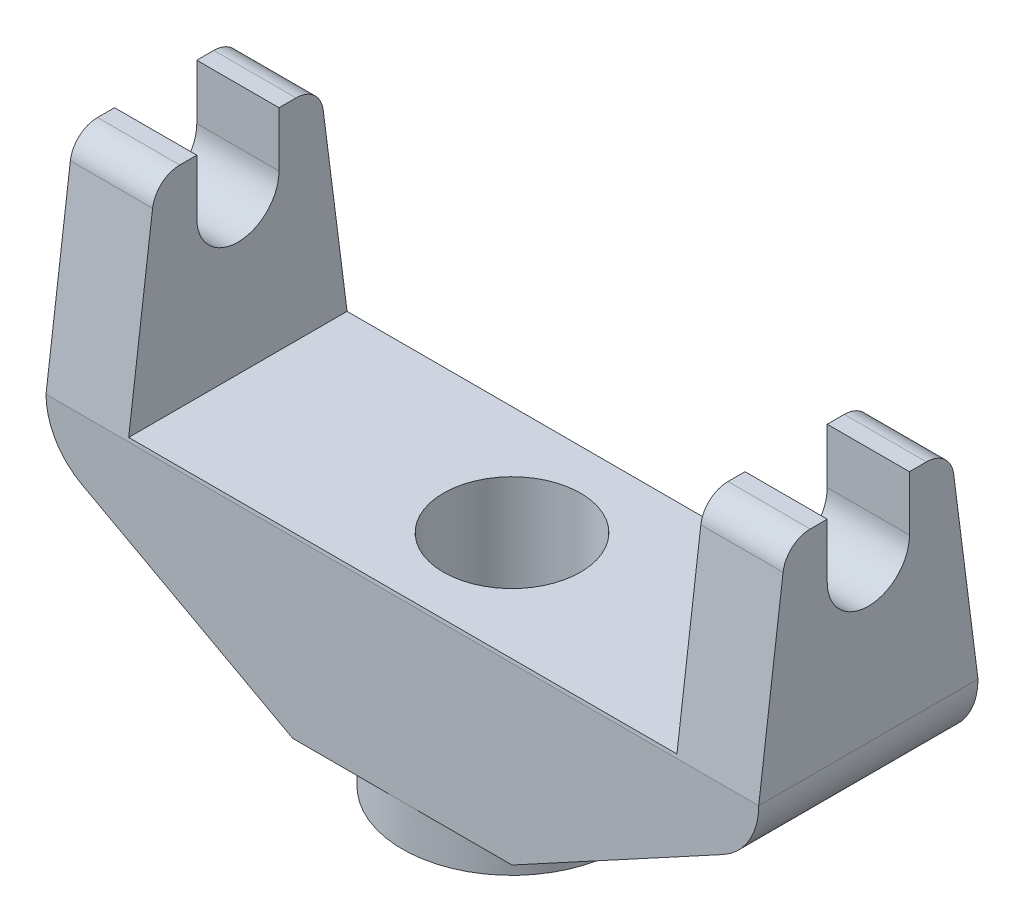
ISO-10303-21;
HEADER;
FILE_DESCRIPTION(('STEP AP214'),'2;1');
FILE_NAME('part.step','',(''),(''),'','','');
FILE_SCHEMA(('AUTOMOTIVE_DESIGN { 1 0 10303 214 1 1 1 1 }'));
ENDSEC;
DATA;
#1=APPLICATION_CONTEXT('core data for automotive mechanical design processes');
#2=APPLICATION_PROTOCOL_DEFINITION('international standard','automotive_design',2000,#1);
#3=PRODUCT_CONTEXT('',#1,'mechanical');
#4=PRODUCT('Part','Part','',(#3));
#5=PRODUCT_RELATED_PRODUCT_CATEGORY('part','',(#4));
#6=PRODUCT_DEFINITION_FORMATION('','',#4);
#7=PRODUCT_DEFINITION_CONTEXT('part definition',#1,'design');
#8=PRODUCT_DEFINITION('design','',#6,#7);
#9=PRODUCT_DEFINITION_SHAPE('','',#8);
#10=(LENGTH_UNIT() NAMED_UNIT(*) SI_UNIT(.MILLI.,.METRE.));
#11=(NAMED_UNIT(*) PLANE_ANGLE_UNIT() SI_UNIT($,.RADIAN.));
#12=(NAMED_UNIT(*) SI_UNIT($,.STERADIAN.) SOLID_ANGLE_UNIT());
#13=UNCERTAINTY_MEASURE_WITH_UNIT(LENGTH_MEASURE(1.E-05),#10,'distance_accuracy_value','');
#14=(GEOMETRIC_REPRESENTATION_CONTEXT(3) GLOBAL_UNCERTAINTY_ASSIGNED_CONTEXT((#13)) GLOBAL_UNIT_ASSIGNED_CONTEXT((#10,
#11,#12)) REPRESENTATION_CONTEXT('',''));
#15=CARTESIAN_POINT('',(0.,0.,0.));
#16=DIRECTION('',(0.,0.,1.));
#17=DIRECTION('',(1.,0.,0.));
#18=AXIS2_PLACEMENT_3D('',#15,#16,#17);
#19=CARTESIAN_POINT('',(165.1,180.036837313202,50.8));
#20=DIRECTION('',(-1.,0.,0.));
#21=DIRECTION('',(0.,0.,1.));
#22=AXIS2_PLACEMENT_3D('',#19,#20,#21);
#23=PLANE('',#22);
#24=DIRECTION('',(0.,-0.991887572463734,-0.127118226828417));
#25=VECTOR('',#24,1.);
#26=CARTESIAN_POINT('',(165.1,7.71313739939229,-60.1846432415168));
#27=LINE('',#26,#25);
#28=CARTESIAN_POINT('',(165.1,168.951238793923,-39.5207070097695));
#29=VERTEX_POINT('',#28);
#30=CARTESIAN_POINT('',(165.1,80.9403309774686,-50.8));
#31=VERTEX_POINT('',#30);
#32=EDGE_CURVE('E218',#29,#31,#27,.T.);
#33=ORIENTED_EDGE('',*,*,#32,.F.);
#34=CARTESIAN_POINT('',(165.1,167.336837313202,-26.9237348394801));
#35=DIRECTION('',(-1.,0.,0.));
#36=DIRECTION('',(0.,0.,1.));
#37=AXIS2_PLACEMENT_3D('',#34,#35,#36);
#38=CIRCLE('',#37,12.7);
#39=CARTESIAN_POINT('',(165.1,180.036837313202,-26.9237348394801));
#40=VERTEX_POINT('',#39);
#41=EDGE_CURVE('E294',#29,#40,#38,.F.);
#42=ORIENTED_EDGE('',*,*,#41,.T.);
#43=DIRECTION('',(0.,0.,-1.));
#44=VECTOR('',#43,1.);
#45=CARTESIAN_POINT('',(165.1,180.036837313202,50.8));
#46=LINE('',#45,#44);
#47=CARTESIAN_POINT('',(165.1,180.036837313202,-19.05));
#48=VERTEX_POINT('',#47);
#49=EDGE_CURVE('E279',#48,#40,#46,.T.);
#50=ORIENTED_EDGE('',*,*,#49,.F.);
#51=DIRECTION('',(0.,1.,0.));
#52=VECTOR('',#51,1.);
#53=CARTESIAN_POINT('',(165.1,0.,-19.05));
#54=LINE('',#53,#52);
#55=CARTESIAN_POINT('',(165.1,154.636837313202,-19.05));
#56=VERTEX_POINT('',#55);
#57=EDGE_CURVE('E351',#56,#48,#54,.T.);
#58=ORIENTED_EDGE('',*,*,#57,.F.);
#59=CARTESIAN_POINT('',(165.1,154.636837313202,0.));
#60=DIRECTION('',(1.,0.,0.));
#61=DIRECTION('',(0.,0.,-1.));
#62=AXIS2_PLACEMENT_3D('',#59,#60,#61);
#63=CIRCLE('',#62,19.05);
#64=CARTESIAN_POINT('',(165.1,154.636837313202,19.05));
#65=VERTEX_POINT('',#64);
#66=EDGE_CURVE('E346',#65,#56,#63,.T.);
#67=ORIENTED_EDGE('',*,*,#66,.F.);
#68=DIRECTION('',(0.,1.,0.));
#69=VECTOR('',#68,1.);
#70=CARTESIAN_POINT('',(165.1,0.,19.05));
#71=LINE('',#70,#69);
#72=CARTESIAN_POINT('',(165.1,180.036837313202,19.05));
#73=VERTEX_POINT('',#72);
#74=EDGE_CURVE('E343',#65,#73,#71,.T.);
#75=ORIENTED_EDGE('',*,*,#74,.T.);
#76=CARTESIAN_POINT('',(165.1,180.036837313202,26.9237348394801));
#77=VERTEX_POINT('',#76);
#78=EDGE_CURVE('E280',#77,#73,#46,.T.);
#79=ORIENTED_EDGE('',*,*,#78,.F.);
#80=CARTESIAN_POINT('',(165.1,167.336837313202,26.9237348394801));
#81=DIRECTION('',(-1.,0.,0.));
#82=DIRECTION('',(0.,0.,1.));
#83=AXIS2_PLACEMENT_3D('',#80,#81,#82);
#84=CIRCLE('',#83,12.7);
#85=CARTESIAN_POINT('',(165.1,168.951238793923,39.5207070097695));
#86=VERTEX_POINT('',#85);
#87=EDGE_CURVE('E292',#77,#86,#84,.F.);
#88=ORIENTED_EDGE('',*,*,#87,.T.);
#89=DIRECTION('',(0.,0.991887572463734,-0.127118226828417));
#90=VECTOR('',#89,1.);
#91=CARTESIAN_POINT('',(165.1,7.71313739939229,60.1846432415168));
#92=LINE('',#91,#90);
#93=CARTESIAN_POINT('',(165.1,80.9403309774686,50.8));
#94=VERTEX_POINT('',#93);
#95=EDGE_CURVE('E322',#94,#86,#92,.T.);
#96=ORIENTED_EDGE('',*,*,#95,.F.);
#97=DIRECTION('',(0.,0.,-1.));
#98=VECTOR('',#97,1.);
#99=CARTESIAN_POINT('',(165.1,80.9403309774686,50.8));
#100=LINE('',#99,#98);
#101=EDGE_CURVE('E282',#94,#31,#100,.T.);
#102=ORIENTED_EDGE('',*,*,#101,.T.);
#103=EDGE_LOOP('',(#33,#42,#50,#58,#67,#75,#79,#88,#96,#102));
#104=FACE_BOUND('',#103,.T.);
#105=ADVANCED_FACE('F33',(#104),#23,.F.);
#106=CARTESIAN_POINT('',(127.,180.036837313202,50.8));
#107=DIRECTION('',(0.,-1.,0.));
#108=DIRECTION('',(1.,0.,0.));
#109=AXIS2_PLACEMENT_3D('',#106,#107,#108);
#110=PLANE('',#109);
#111=DIRECTION('',(0.,0.,-1.));
#112=VECTOR('',#111,1.);
#113=CARTESIAN_POINT('',(127.,180.036837313202,50.8));
#114=LINE('',#113,#112);
#115=CARTESIAN_POINT('',(127.,180.036837313202,26.9237348394801));
#116=VERTEX_POINT('',#115);
#117=CARTESIAN_POINT('',(127.,180.036837313202,19.05));
#118=VERTEX_POINT('',#117);
#119=EDGE_CURVE('E277',#116,#118,#114,.T.);
#120=ORIENTED_EDGE('',*,*,#119,.F.);
#121=DIRECTION('',(1.,0.,0.));
#122=VECTOR('',#121,1.);
#123=CARTESIAN_POINT('',(127.,180.036837313202,26.9237348394801));
#124=LINE('',#123,#122);
#125=EDGE_CURVE('E11',#116,#77,#124,.T.);
#126=ORIENTED_EDGE('',*,*,#125,.T.);
#127=ORIENTED_EDGE('',*,*,#78,.T.);
#128=DIRECTION('',(1.,0.,0.));
#129=VECTOR('',#128,1.);
#130=CARTESIAN_POINT('',(-165.1,180.036837313202,19.05));
#131=LINE('',#130,#129);
#132=EDGE_CURVE('E365',#118,#73,#131,.T.);
#133=ORIENTED_EDGE('',*,*,#132,.F.);
#134=EDGE_LOOP('',(#120,#126,#127,#133));
#135=FACE_BOUND('',#134,.T.);
#136=ADVANCED_FACE('F336',(#135),#110,.F.);
#137=CARTESIAN_POINT('',(127.,82.55,50.8));
#138=DIRECTION('',(1.,0.,0.));
#139=DIRECTION('',(0.,0.,-1.));
#140=AXIS2_PLACEMENT_3D('',#137,#138,#139);
#141=PLANE('',#140);
#142=CARTESIAN_POINT('',(127.,180.036837313202,-19.05));
#143=VERTEX_POINT('',#142);
#144=CARTESIAN_POINT('',(127.,180.036837313202,-26.9237348394801));
#145=VERTEX_POINT('',#144);
#146=EDGE_CURVE('E276',#143,#145,#114,.T.);
#147=ORIENTED_EDGE('',*,*,#146,.T.);
#148=CARTESIAN_POINT('',(127.,167.336837313202,-26.9237348394801));
#149=DIRECTION('',(1.,0.,0.));
#150=DIRECTION('',(0.,0.,-1.));
#151=AXIS2_PLACEMENT_3D('',#148,#149,#150);
#152=CIRCLE('',#151,12.7);
#153=CARTESIAN_POINT('',(127.,168.951238793923,-39.5207070097695));
#154=VERTEX_POINT('',#153);
#155=EDGE_CURVE('E300',#145,#154,#152,.F.);
#156=ORIENTED_EDGE('',*,*,#155,.T.);
#157=DIRECTION('',(0.,-0.991887572463734,-0.127118226828417));
#158=VECTOR('',#157,1.);
#159=CARTESIAN_POINT('',(127.,95.334427413649,-48.9552828500315));
#160=LINE('',#159,#158);
#161=CARTESIAN_POINT('',(127.,82.55,-50.5937082008029));
#162=VERTEX_POINT('',#161);
#163=EDGE_CURVE('E349',#154,#162,#160,.T.);
#164=ORIENTED_EDGE('',*,*,#163,.T.);
#165=DIRECTION('',(0.,0.,-1.));
#166=VECTOR('',#165,1.);
#167=CARTESIAN_POINT('',(127.,82.55,50.8));
#168=LINE('',#167,#166);
#169=CARTESIAN_POINT('',(127.,82.55,50.5937082008029));
#170=VERTEX_POINT('',#169);
#171=EDGE_CURVE('E273',#170,#162,#168,.T.);
#172=ORIENTED_EDGE('',*,*,#171,.F.);
#173=DIRECTION('',(0.,0.991887572463734,-0.127118226828417));
#174=VECTOR('',#173,1.);
#175=CARTESIAN_POINT('',(127.,82.5239892880962,50.5970416789788));
#176=LINE('',#175,#174);
#177=CARTESIAN_POINT('',(127.,168.951238793923,39.5207070097695));
#178=VERTEX_POINT('',#177);
#179=EDGE_CURVE('E319',#170,#178,#176,.T.);
#180=ORIENTED_EDGE('',*,*,#179,.T.);
#181=CARTESIAN_POINT('',(127.,167.336837313202,26.9237348394801));
#182=DIRECTION('',(1.,0.,0.));
#183=DIRECTION('',(0.,0.,-1.));
#184=AXIS2_PLACEMENT_3D('',#181,#182,#183);
#185=CIRCLE('',#184,12.7);
#186=EDGE_CURVE('E298',#178,#116,#185,.F.);
#187=ORIENTED_EDGE('',*,*,#186,.T.);
#188=ORIENTED_EDGE('',*,*,#119,.T.);
#189=DIRECTION('',(0.,1.,0.));
#190=VECTOR('',#189,1.);
#191=CARTESIAN_POINT('',(127.,82.55,19.05));
#192=LINE('',#191,#190);
#193=CARTESIAN_POINT('',(127.,154.636837313202,19.05));
#194=VERTEX_POINT('',#193);
#195=EDGE_CURVE('E391',#194,#118,#192,.T.);
#196=ORIENTED_EDGE('',*,*,#195,.F.);
#197=CARTESIAN_POINT('',(127.,154.636837313202,0.));
#198=DIRECTION('',(1.,0.,0.));
#199=DIRECTION('',(0.,0.,-1.));
#200=AXIS2_PLACEMENT_3D('',#197,#198,#199);
#201=CIRCLE('',#200,19.05);
#202=CARTESIAN_POINT('',(127.,154.636837313202,-19.05));
#203=VERTEX_POINT('',#202);
#204=EDGE_CURVE('E380',#194,#203,#201,.T.);
#205=ORIENTED_EDGE('',*,*,#204,.T.);
#206=DIRECTION('',(0.,1.,0.));
#207=VECTOR('',#206,1.);
#208=CARTESIAN_POINT('',(127.,82.55,-19.05));
#209=LINE('',#208,#207);
#210=EDGE_CURVE('E386',#203,#143,#209,.T.);
#211=ORIENTED_EDGE('',*,*,#210,.T.);
#212=EDGE_LOOP('',(#147,#156,#164,#172,#180,#187,#188,#196,#205,#211));
#213=FACE_BOUND('',#212,.T.);
#214=ADVANCED_FACE('F328',(#213),#141,.F.);
#215=CARTESIAN_POINT('',(-127.,82.55,50.8));
#216=DIRECTION('',(-1.,0.,0.));
#217=DIRECTION('',(0.,0.,1.));
#218=AXIS2_PLACEMENT_3D('',#215,#216,#217);
#219=PLANE('',#218);
#220=DIRECTION('',(0.,0.991887572463734,0.127118226828417));
#221=VECTOR('',#220,1.);
#222=CARTESIAN_POINT('',(-127.,95.334427413649,-48.9552828500315));
#223=LINE('',#222,#221);
#224=CARTESIAN_POINT('',(-127.,82.55,-50.5937082008029));
#225=VERTEX_POINT('',#224);
#226=CARTESIAN_POINT('',(-127.,168.951238793923,-39.5207070097695));
#227=VERTEX_POINT('',#226);
#228=EDGE_CURVE('E353',#225,#227,#223,.T.);
#229=ORIENTED_EDGE('',*,*,#228,.T.);
#230=CARTESIAN_POINT('',(-127.,167.336837313202,-26.9237348394801));
#231=DIRECTION('',(-1.,0.,0.));
#232=DIRECTION('',(0.,0.,1.));
#233=AXIS2_PLACEMENT_3D('',#230,#231,#232);
#234=CIRCLE('',#233,12.7);
#235=CARTESIAN_POINT('',(-127.,180.036837313202,-26.9237348394801));
#236=VERTEX_POINT('',#235);
#237=EDGE_CURVE('E304',#227,#236,#234,.F.);
#238=ORIENTED_EDGE('',*,*,#237,.T.);
#239=DIRECTION('',(0.,0.,-1.));
#240=VECTOR('',#239,1.);
#241=CARTESIAN_POINT('',(-127.,180.036837313202,50.8));
#242=LINE('',#241,#240);
#243=CARTESIAN_POINT('',(-127.,180.036837313202,-19.05));
#244=VERTEX_POINT('',#243);
#245=EDGE_CURVE('E267',#244,#236,#242,.T.);
#246=ORIENTED_EDGE('',*,*,#245,.F.);
#247=DIRECTION('',(0.,-1.,0.));
#248=VECTOR('',#247,1.);
#249=CARTESIAN_POINT('',(-127.,82.55,-19.05));
#250=LINE('',#249,#248);
#251=CARTESIAN_POINT('',(-127.,154.636837313202,-19.05));
#252=VERTEX_POINT('',#251);
#253=EDGE_CURVE('E383',#244,#252,#250,.T.);
#254=ORIENTED_EDGE('',*,*,#253,.T.);
#255=CARTESIAN_POINT('',(-127.,154.636837313202,0.));
#256=DIRECTION('',(-1.,0.,0.));
#257=DIRECTION('',(0.,0.,1.));
#258=AXIS2_PLACEMENT_3D('',#255,#256,#257);
#259=CIRCLE('',#258,19.05);
#260=CARTESIAN_POINT('',(-127.,154.636837313202,19.05));
#261=VERTEX_POINT('',#260);
#262=EDGE_CURVE('E364',#252,#261,#259,.T.);
#263=ORIENTED_EDGE('',*,*,#262,.T.);
#264=DIRECTION('',(0.,-1.,0.));
#265=VECTOR('',#264,1.);
#266=CARTESIAN_POINT('',(-127.,82.55,19.05));
#267=LINE('',#266,#265);
#268=CARTESIAN_POINT('',(-127.,180.036837313202,19.05));
#269=VERTEX_POINT('',#268);
#270=EDGE_CURVE('E389',#269,#261,#267,.T.);
#271=ORIENTED_EDGE('',*,*,#270,.F.);
#272=CARTESIAN_POINT('',(-127.,180.036837313202,26.9237348394801));
#273=VERTEX_POINT('',#272);
#274=EDGE_CURVE('E268',#273,#269,#242,.T.);
#275=ORIENTED_EDGE('',*,*,#274,.F.);
#276=CARTESIAN_POINT('',(-127.,167.336837313202,26.9237348394801));
#277=DIRECTION('',(-1.,0.,0.));
#278=DIRECTION('',(0.,0.,1.));
#279=AXIS2_PLACEMENT_3D('',#276,#277,#278);
#280=CIRCLE('',#279,12.7);
#281=CARTESIAN_POINT('',(-127.,168.951238793923,39.5207070097695));
#282=VERTEX_POINT('',#281);
#283=EDGE_CURVE('E302',#273,#282,#280,.F.);
#284=ORIENTED_EDGE('',*,*,#283,.T.);
#285=DIRECTION('',(0.,-0.991887572463734,0.127118226828417));
#286=VECTOR('',#285,1.);
#287=CARTESIAN_POINT('',(-127.,82.5239892880962,50.5970416789788));
#288=LINE('',#287,#286);
#289=CARTESIAN_POINT('',(-127.,82.55,50.5937082008029));
#290=VERTEX_POINT('',#289);
#291=EDGE_CURVE('E399',#282,#290,#288,.T.);
#292=ORIENTED_EDGE('',*,*,#291,.T.);
#293=DIRECTION('',(0.,0.,-1.));
#294=VECTOR('',#293,1.);
#295=CARTESIAN_POINT('',(-127.,82.55,50.8));
#296=LINE('',#295,#294);
#297=EDGE_CURVE('E270',#290,#225,#296,.T.);
#298=ORIENTED_EDGE('',*,*,#297,.T.);
#299=EDGE_LOOP('',(#229,#238,#246,#254,#263,#271,#275,#284,#292,#298));
#300=FACE_BOUND('',#299,.T.);
#301=ADVANCED_FACE('F509',(#300),#219,.F.);
#302=CARTESIAN_POINT('',(-127.,180.036837313202,50.8));
#303=DIRECTION('',(0.,-1.,0.));
#304=DIRECTION('',(1.,0.,0.));
#305=AXIS2_PLACEMENT_3D('',#302,#303,#304);
#306=PLANE('',#305);
#307=DIRECTION('',(0.,0.,-1.));
#308=VECTOR('',#307,1.);
#309=CARTESIAN_POINT('',(-165.1,180.036837313202,50.8));
#310=LINE('',#309,#308);
#311=CARTESIAN_POINT('',(-165.1,180.036837313202,26.9237348394801));
#312=VERTEX_POINT('',#311);
#313=CARTESIAN_POINT('',(-165.1,180.036837313202,19.05));
#314=VERTEX_POINT('',#313);
#315=EDGE_CURVE('E265',#312,#314,#310,.T.);
#316=ORIENTED_EDGE('',*,*,#315,.F.);
#317=DIRECTION('',(1.,0.,0.));
#318=VECTOR('',#317,1.);
#319=CARTESIAN_POINT('',(-127.,180.036837313202,26.9237348394801));
#320=LINE('',#319,#318);
#321=EDGE_CURVE('E310',#312,#273,#320,.T.);
#322=ORIENTED_EDGE('',*,*,#321,.T.);
#323=ORIENTED_EDGE('',*,*,#274,.T.);
#324=EDGE_CURVE('E361',#314,#269,#131,.T.);
#325=ORIENTED_EDGE('',*,*,#324,.F.);
#326=EDGE_LOOP('',(#316,#322,#323,#325));
#327=FACE_BOUND('',#326,.T.);
#328=ADVANCED_FACE('F504',(#327),#306,.F.);
#329=CARTESIAN_POINT('',(-165.1,180.036837313202,50.8));
#330=DIRECTION('',(1.,0.,0.));
#331=DIRECTION('',(0.,0.,-1.));
#332=AXIS2_PLACEMENT_3D('',#329,#330,#331);
#333=PLANE('',#332);
#334=CARTESIAN_POINT('',(-165.1,180.036837313202,-19.05));
#335=VERTEX_POINT('',#334);
#336=CARTESIAN_POINT('',(-165.1,180.036837313202,-26.9237348394801));
#337=VERTEX_POINT('',#336);
#338=EDGE_CURVE('E236',#335,#337,#310,.T.);
#339=ORIENTED_EDGE('',*,*,#338,.T.);
#340=CARTESIAN_POINT('',(-165.1,167.336837313202,-26.9237348394801));
#341=DIRECTION('',(1.,0.,0.));
#342=DIRECTION('',(0.,0.,-1.));
#343=AXIS2_PLACEMENT_3D('',#340,#341,#342);
#344=CIRCLE('',#343,12.7);
#345=CARTESIAN_POINT('',(-165.1,168.951238793923,-39.5207070097695));
#346=VERTEX_POINT('',#345);
#347=EDGE_CURVE('E213',#337,#346,#344,.F.);
#348=ORIENTED_EDGE('',*,*,#347,.T.);
#349=DIRECTION('',(0.,-0.991887572463734,-0.127118226828417));
#350=VECTOR('',#349,1.);
#351=CARTESIAN_POINT('',(-165.1,7.71313739939229,-60.1846432415168));
#352=LINE('',#351,#350);
#353=CARTESIAN_POINT('',(-165.1,80.9403309774686,-50.8));
#354=VERTEX_POINT('',#353);
#355=EDGE_CURVE('E205',#346,#354,#352,.T.);
#356=ORIENTED_EDGE('',*,*,#355,.T.);
#357=DIRECTION('',(0.,0.,-1.));
#358=VECTOR('',#357,1.);
#359=CARTESIAN_POINT('',(-165.1,80.9403309774686,50.8));
#360=LINE('',#359,#358);
#361=CARTESIAN_POINT('',(-165.1,80.9403309774686,50.8));
#362=VERTEX_POINT('',#361);
#363=EDGE_CURVE('E210',#362,#354,#360,.T.);
#364=ORIENTED_EDGE('',*,*,#363,.F.);
#365=DIRECTION('',(0.,0.991887572463734,-0.127118226828417));
#366=VECTOR('',#365,1.);
#367=CARTESIAN_POINT('',(-165.1,7.71313739939229,60.1846432415168));
#368=LINE('',#367,#366);
#369=CARTESIAN_POINT('',(-165.1,168.951238793923,39.5207070097695));
#370=VERTEX_POINT('',#369);
#371=EDGE_CURVE('E394',#362,#370,#368,.T.);
#372=ORIENTED_EDGE('',*,*,#371,.T.);
#373=CARTESIAN_POINT('',(-165.1,167.336837313202,26.9237348394801));
#374=DIRECTION('',(1.,0.,0.));
#375=DIRECTION('',(0.,0.,-1.));
#376=AXIS2_PLACEMENT_3D('',#373,#374,#375);
#377=CIRCLE('',#376,12.7);
#378=EDGE_CURVE('E48',#370,#312,#377,.F.);
#379=ORIENTED_EDGE('',*,*,#378,.T.);
#380=ORIENTED_EDGE('',*,*,#315,.T.);
#381=DIRECTION('',(0.,1.,0.));
#382=VECTOR('',#381,1.);
#383=CARTESIAN_POINT('',(-165.1,0.,19.05));
#384=LINE('',#383,#382);
#385=CARTESIAN_POINT('',(-165.1,154.636837313202,19.05));
#386=VERTEX_POINT('',#385);
#387=EDGE_CURVE('E360',#386,#314,#384,.T.);
#388=ORIENTED_EDGE('',*,*,#387,.F.);
#389=CARTESIAN_POINT('',(-165.1,154.636837313202,0.));
#390=DIRECTION('',(1.,0.,0.));
#391=DIRECTION('',(0.,0.,-1.));
#392=AXIS2_PLACEMENT_3D('',#389,#390,#391);
#393=CIRCLE('',#392,19.05);
#394=CARTESIAN_POINT('',(-165.1,154.636837313202,-19.05));
#395=VERTEX_POINT('',#394);
#396=EDGE_CURVE('E518',#386,#395,#393,.T.);
#397=ORIENTED_EDGE('',*,*,#396,.T.);
#398=DIRECTION('',(0.,1.,0.));
#399=VECTOR('',#398,1.);
#400=CARTESIAN_POINT('',(-165.1,0.,-19.05));
#401=LINE('',#400,#399);
#402=EDGE_CURVE('E356',#395,#335,#401,.T.);
#403=ORIENTED_EDGE('',*,*,#402,.T.);
#404=EDGE_LOOP('',(#339,#348,#356,#364,#372,#379,#380,#388,#397,#403));
#405=FACE_BOUND('',#404,.T.);
#406=ADVANCED_FACE('F208',(#405),#333,.F.);
#407=CARTESIAN_POINT('',(-50.8,0.,50.8));
#408=DIRECTION('',(0.,1.,0.));
#409=DIRECTION('',(0.,0.,1.));
#410=AXIS2_PLACEMENT_3D('',#407,#408,#409);
#411=PLANE('',#410);
#412=DIRECTION('',(1.,0.,0.));
#413=VECTOR('',#412,1.);
#414=CARTESIAN_POINT('',(-50.8,0.,50.8));
#415=LINE('',#414,#413);
#416=CARTESIAN_POINT('',(0.,0.,50.8));
#417=VERTEX_POINT('',#416);
#418=CARTESIAN_POINT('',(50.8,0.,50.8));
#419=VERTEX_POINT('',#418);
#420=EDGE_CURVE('E423',#417,#419,#415,.T.);
#421=ORIENTED_EDGE('',*,*,#420,.F.);
#422=CARTESIAN_POINT('',(0.,0.,0.));
#423=DIRECTION('',(0.,1.,0.));
#424=DIRECTION('',(0.,0.,1.));
#425=AXIS2_PLACEMENT_3D('',#422,#423,#424);
#426=CIRCLE('',#425,50.8);
#427=CARTESIAN_POINT('',(50.8,0.,0.));
#428=VERTEX_POINT('',#427);
#429=EDGE_CURVE('E431',#417,#428,#426,.T.);
#430=ORIENTED_EDGE('',*,*,#429,.T.);
#431=DIRECTION('',(0.,0.,-1.));
#432=VECTOR('',#431,1.);
#433=CARTESIAN_POINT('',(50.8,0.,50.8));
#434=LINE('',#433,#432);
#435=EDGE_CURVE('E256',#419,#428,#434,.T.);
#436=ORIENTED_EDGE('',*,*,#435,.F.);
#437=EDGE_LOOP('',(#421,#430,#436));
#438=FACE_BOUND('',#437,.T.);
#439=ADVANCED_FACE('F446',(#438),#411,.F.);
#440=CARTESIAN_POINT('',(50.8,0.,-50.8));
#441=VERTEX_POINT('',#440);
#442=EDGE_CURVE('E260',#428,#441,#434,.T.);
#443=ORIENTED_EDGE('',*,*,#442,.F.);
#444=CARTESIAN_POINT('',(0.,0.,-50.8));
#445=VERTEX_POINT('',#444);
#446=EDGE_CURVE('E414',#428,#445,#426,.T.);
#447=ORIENTED_EDGE('',*,*,#446,.T.);
#448=DIRECTION('',(1.,0.,0.));
#449=VECTOR('',#448,1.);
#450=CARTESIAN_POINT('',(-50.8,0.,-50.8));
#451=LINE('',#450,#449);
#452=EDGE_CURVE('E246',#445,#441,#451,.T.);
#453=ORIENTED_EDGE('',*,*,#452,.T.);
#454=EDGE_LOOP('',(#443,#447,#453));
#455=FACE_BOUND('',#454,.T.);
#456=ADVANCED_FACE('F552',(#455),#411,.F.);
#457=CARTESIAN_POINT('',(-50.8,0.,-50.8));
#458=VERTEX_POINT('',#457);
#459=EDGE_CURVE('E252',#458,#445,#451,.T.);
#460=ORIENTED_EDGE('',*,*,#459,.T.);
#461=CARTESIAN_POINT('',(-50.8,0.,0.));
#462=VERTEX_POINT('',#461);
#463=EDGE_CURVE('E410',#445,#462,#426,.T.);
#464=ORIENTED_EDGE('',*,*,#463,.T.);
#465=DIRECTION('',(0.,0.,-1.));
#466=VECTOR('',#465,1.);
#467=CARTESIAN_POINT('',(-50.8,0.,50.8));
#468=LINE('',#467,#466);
#469=EDGE_CURVE('E259',#462,#458,#468,.T.);
#470=ORIENTED_EDGE('',*,*,#469,.T.);
#471=EDGE_LOOP('',(#460,#464,#470));
#472=FACE_BOUND('',#471,.T.);
#473=ADVANCED_FACE('F456',(#472),#411,.F.);
#474=CARTESIAN_POINT('',(50.8,0.,50.8));
#475=DIRECTION('',(-0.47709782670046,0.878850194150116,0.));
#476=DIRECTION('',(-0.878850194150117,-0.47709782670046,0.));
#477=AXIS2_PLACEMENT_3D('',#474,#475,#476);
#478=PLANE('',#477);
#479=DIRECTION('',(0.878850194150117,0.47709782670046,0.));
#480=VECTOR('',#479,1.);
#481=CARTESIAN_POINT('',(50.8,0.,-50.8));
#482=LINE('',#481,#480);
#483=CARTESIAN_POINT('',(148.49785599774,53.0368373132024,-50.8));
#484=VERTEX_POINT('',#483);
#485=EDGE_CURVE('E248',#441,#484,#482,.T.);
#486=ORIENTED_EDGE('',*,*,#485,.T.);
#487=DIRECTION('',(0.,0.,-1.));
#488=VECTOR('',#487,1.);
#489=CARTESIAN_POINT('',(148.49785599774,53.0368373132024,50.8));
#490=LINE('',#489,#488);
#491=CARTESIAN_POINT('',(148.49785599774,53.0368373132024,50.8));
#492=VERTEX_POINT('',#491);
#493=EDGE_CURVE('E285',#492,#484,#490,.T.);
#494=ORIENTED_EDGE('',*,*,#493,.F.);
#495=DIRECTION('',(0.878850194150117,0.47709782670046,0.));
#496=VECTOR('',#495,1.);
#497=CARTESIAN_POINT('',(50.8,0.,50.8));
#498=LINE('',#497,#496);
#499=EDGE_CURVE('E255',#419,#492,#498,.T.);
#500=ORIENTED_EDGE('',*,*,#499,.F.);
#501=ORIENTED_EDGE('',*,*,#435,.T.);
#502=ORIENTED_EDGE('',*,*,#442,.T.);
#503=EDGE_LOOP('',(#486,#494,#500,#501,#502));
#504=FACE_BOUND('',#503,.T.);
#505=ADVANCED_FACE('F484',(#504),#478,.F.);
#506=CARTESIAN_POINT('',(133.35,80.9403309774686,50.8));
#507=DIRECTION('',(0.,0.,-1.));
#508=DIRECTION('',(-1.,0.,0.));
#509=AXIS2_PLACEMENT_3D('',#506,#507,#508);
#510=CYLINDRICAL_SURFACE('',#509,31.75);
#511=CARTESIAN_POINT('',(133.35,80.9403309774686,-50.8));
#512=DIRECTION('',(0.,0.,1.));
#513=DIRECTION('',(1.,0.,0.));
#514=AXIS2_PLACEMENT_3D('',#511,#512,#513);
#515=CIRCLE('',#514,31.75);
#516=EDGE_CURVE('E244',#484,#31,#515,.T.);
#517=ORIENTED_EDGE('',*,*,#516,.T.);
#518=ORIENTED_EDGE('',*,*,#101,.F.);
#519=CARTESIAN_POINT('',(133.35,80.9403309774686,50.8));
#520=DIRECTION('',(0.,0.,1.));
#521=DIRECTION('',(1.,0.,0.));
#522=AXIS2_PLACEMENT_3D('',#519,#520,#521);
#523=CIRCLE('',#522,31.75);
#524=EDGE_CURVE('E417',#492,#94,#523,.T.);
#525=ORIENTED_EDGE('',*,*,#524,.F.);
#526=ORIENTED_EDGE('',*,*,#493,.T.);
#527=EDGE_LOOP('',(#517,#518,#525,#526));
#528=FACE_BOUND('',#527,.T.);
#529=ADVANCED_FACE('F481',(#528),#510,.T.);
#530=ORIENTED_EDGE('',*,*,#49,.T.);
#531=DIRECTION('',(1.,0.,0.));
#532=VECTOR('',#531,1.);
#533=CARTESIAN_POINT('',(127.,180.036837313202,-26.9237348394801));
#534=LINE('',#533,#532);
#535=EDGE_CURVE('E296',#40,#145,#534,.F.);
#536=ORIENTED_EDGE('',*,*,#535,.T.);
#537=ORIENTED_EDGE('',*,*,#146,.F.);
#538=DIRECTION('',(1.,0.,0.));
#539=VECTOR('',#538,1.);
#540=CARTESIAN_POINT('',(-165.1,180.036837313202,-19.05));
#541=LINE('',#540,#539);
#542=EDGE_CURVE('E369',#143,#48,#541,.T.);
#543=ORIENTED_EDGE('',*,*,#542,.T.);
#544=EDGE_LOOP('',(#530,#536,#537,#543));
#545=FACE_BOUND('',#544,.T.);
#546=ADVANCED_FACE('F478',(#545),#110,.F.);
#547=CARTESIAN_POINT('',(-127.,82.55,50.8));
#548=DIRECTION('',(0.,-1.,0.));
#549=DIRECTION('',(0.,0.,-1.));
#550=AXIS2_PLACEMENT_3D('',#547,#548,#549);
#551=PLANE('',#550);
#552=CARTESIAN_POINT('',(0.,82.55,0.));
#553=DIRECTION('',(0.,1.,0.));
#554=DIRECTION('',(0.,0.,1.));
#555=AXIS2_PLACEMENT_3D('',#552,#553,#554);
#556=CIRCLE('',#555,31.75);
#557=CARTESIAN_POINT('',(0.,82.55,31.75));
#558=VERTEX_POINT('',#557);
#559=EDGE_CURVE('E330',#558,#558,#556,.T.);
#560=ORIENTED_EDGE('',*,*,#559,.F.);
#561=EDGE_LOOP('',(#560));
#562=FACE_BOUND('',#561,.T.);
#563=ORIENTED_EDGE('',*,*,#171,.T.);
#564=DIRECTION('',(-1.,0.,0.));
#565=VECTOR('',#564,1.);
#566=CARTESIAN_POINT('',(-127.,82.55,-50.5937082008029));
#567=LINE('',#566,#565);
#568=EDGE_CURVE('E228',#162,#225,#567,.T.);
#569=ORIENTED_EDGE('',*,*,#568,.T.);
#570=ORIENTED_EDGE('',*,*,#297,.F.);
#571=DIRECTION('',(1.,0.,0.));
#572=VECTOR('',#571,1.);
#573=CARTESIAN_POINT('',(-127.,82.55,50.5937082008029));
#574=LINE('',#573,#572);
#575=EDGE_CURVE('E331',#290,#170,#574,.T.);
#576=ORIENTED_EDGE('',*,*,#575,.T.);
#577=EDGE_LOOP('',(#563,#569,#570,#576));
#578=FACE_BOUND('',#577,.T.);
#579=ADVANCED_FACE('F529',(#562,#578),#551,.F.);
#580=ORIENTED_EDGE('',*,*,#245,.T.);
#581=DIRECTION('',(1.,0.,0.));
#582=VECTOR('',#581,1.);
#583=CARTESIAN_POINT('',(-127.,180.036837313202,-26.9237348394801));
#584=LINE('',#583,#582);
#585=EDGE_CURVE('E306',#236,#337,#584,.F.);
#586=ORIENTED_EDGE('',*,*,#585,.T.);
#587=ORIENTED_EDGE('',*,*,#338,.F.);
#588=EDGE_CURVE('E366',#335,#244,#541,.T.);
#589=ORIENTED_EDGE('',*,*,#588,.T.);
#590=EDGE_LOOP('',(#580,#586,#587,#589));
#591=FACE_BOUND('',#590,.T.);
#592=ADVANCED_FACE('F535',(#591),#306,.F.);
#593=CARTESIAN_POINT('',(-133.35,80.9403309774686,50.8));
#594=DIRECTION('',(0.,0.,-1.));
#595=DIRECTION('',(-1.,0.,0.));
#596=AXIS2_PLACEMENT_3D('',#593,#594,#595);
#597=CYLINDRICAL_SURFACE('',#596,31.75);
#598=CARTESIAN_POINT('',(-133.35,80.9403309774686,-50.8));
#599=DIRECTION('',(0.,0.,1.));
#600=DIRECTION('',(-1.,0.,0.));
#601=AXIS2_PLACEMENT_3D('',#598,#599,#600);
#602=CIRCLE('',#601,31.75);
#603=CARTESIAN_POINT('',(-148.49785599774,53.0368373132024,-50.8));
#604=VERTEX_POINT('',#603);
#605=EDGE_CURVE('E233',#354,#604,#602,.T.);
#606=ORIENTED_EDGE('',*,*,#605,.T.);
#607=DIRECTION('',(0.,0.,-1.));
#608=VECTOR('',#607,1.);
#609=CARTESIAN_POINT('',(-148.49785599774,53.0368373132024,50.8));
#610=LINE('',#609,#608);
#611=CARTESIAN_POINT('',(-148.49785599774,53.0368373132024,50.8));
#612=VERTEX_POINT('',#611);
#613=EDGE_CURVE('E237',#612,#604,#610,.T.);
#614=ORIENTED_EDGE('',*,*,#613,.F.);
#615=CARTESIAN_POINT('',(-133.35,80.9403309774686,50.8));
#616=DIRECTION('',(0.,0.,1.));
#617=DIRECTION('',(-1.,0.,0.));
#618=AXIS2_PLACEMENT_3D('',#615,#616,#617);
#619=CIRCLE('',#618,31.75);
#620=EDGE_CURVE('E235',#362,#612,#619,.T.);
#621=ORIENTED_EDGE('',*,*,#620,.F.);
#622=ORIENTED_EDGE('',*,*,#363,.T.);
#623=EDGE_LOOP('',(#606,#614,#621,#622));
#624=FACE_BOUND('',#623,.T.);
#625=ADVANCED_FACE('F231',(#624),#597,.T.);
#626=CARTESIAN_POINT('',(-50.8,0.,50.8));
#627=DIRECTION('',(0.47709782670046,0.878850194150116,0.));
#628=DIRECTION('',(-0.878850194150117,0.47709782670046,0.));
#629=AXIS2_PLACEMENT_3D('',#626,#627,#628);
#630=PLANE('',#629);
#631=DIRECTION('',(0.878850194150117,-0.47709782670046,0.));
#632=VECTOR('',#631,1.);
#633=CARTESIAN_POINT('',(-50.8,0.,-50.8));
#634=LINE('',#633,#632);
#635=EDGE_CURVE('E243',#604,#458,#634,.T.);
#636=ORIENTED_EDGE('',*,*,#635,.T.);
#637=ORIENTED_EDGE('',*,*,#469,.F.);
#638=CARTESIAN_POINT('',(-50.8,0.,50.8));
#639=VERTEX_POINT('',#638);
#640=EDGE_CURVE('E261',#639,#462,#468,.T.);
#641=ORIENTED_EDGE('',*,*,#640,.F.);
#642=DIRECTION('',(0.878850194150117,-0.47709782670046,0.));
#643=VECTOR('',#642,1.);
#644=CARTESIAN_POINT('',(-50.8,0.,50.8));
#645=LINE('',#644,#643);
#646=EDGE_CURVE('E421',#612,#639,#645,.T.);
#647=ORIENTED_EDGE('',*,*,#646,.F.);
#648=ORIENTED_EDGE('',*,*,#613,.T.);
#649=EDGE_LOOP('',(#636,#637,#641,#647,#648));
#650=FACE_BOUND('',#649,.T.);
#651=ADVANCED_FACE('F454',(#650),#630,.F.);
#652=ORIENTED_EDGE('',*,*,#640,.T.);
#653=EDGE_CURVE('E413',#462,#417,#426,.T.);
#654=ORIENTED_EDGE('',*,*,#653,.T.);
#655=EDGE_CURVE('E424',#639,#417,#415,.T.);
#656=ORIENTED_EDGE('',*,*,#655,.F.);
#657=EDGE_LOOP('',(#652,#654,#656));
#658=FACE_BOUND('',#657,.T.);
#659=ADVANCED_FACE('F443',(#658),#411,.F.);
#660=CARTESIAN_POINT('',(133.35,80.9403309774686,50.8));
#661=DIRECTION('',(0.,0.,1.));
#662=DIRECTION('',(1.,0.,0.));
#663=AXIS2_PLACEMENT_3D('',#660,#661,#662);
#664=PLANE('',#663);
#665=DIRECTION('',(1.,0.,0.));
#666=VECTOR('',#665,1.);
#667=CARTESIAN_POINT('',(-165.1,80.9403309774686,50.8));
#668=LINE('',#667,#666);
#669=EDGE_CURVE('E396',#362,#94,#668,.T.);
#670=ORIENTED_EDGE('',*,*,#669,.F.);
#671=ORIENTED_EDGE('',*,*,#620,.T.);
#672=ORIENTED_EDGE('',*,*,#646,.T.);
#673=ORIENTED_EDGE('',*,*,#655,.T.);
#674=ORIENTED_EDGE('',*,*,#420,.T.);
#675=ORIENTED_EDGE('',*,*,#499,.T.);
#676=ORIENTED_EDGE('',*,*,#524,.T.);
#677=EDGE_LOOP('',(#670,#671,#672,#673,#674,#675,#676));
#678=FACE_BOUND('',#677,.T.);
#679=ADVANCED_FACE('F450',(#678),#664,.T.);
#680=CARTESIAN_POINT('',(133.35,80.9403309774686,-50.8));
#681=DIRECTION('',(0.,0.,1.));
#682=DIRECTION('',(1.,0.,0.));
#683=AXIS2_PLACEMENT_3D('',#680,#681,#682);
#684=PLANE('',#683);
#685=ORIENTED_EDGE('',*,*,#605,.F.);
#686=DIRECTION('',(1.,0.,0.));
#687=VECTOR('',#686,1.);
#688=CARTESIAN_POINT('',(-165.1,80.9403309774686,-50.8));
#689=LINE('',#688,#687);
#690=EDGE_CURVE('E217',#354,#31,#689,.T.);
#691=ORIENTED_EDGE('',*,*,#690,.T.);
#692=ORIENTED_EDGE('',*,*,#516,.F.);
#693=ORIENTED_EDGE('',*,*,#485,.F.);
#694=ORIENTED_EDGE('',*,*,#452,.F.);
#695=ORIENTED_EDGE('',*,*,#459,.F.);
#696=ORIENTED_EDGE('',*,*,#635,.F.);
#697=EDGE_LOOP('',(#685,#691,#692,#693,#694,#695,#696));
#698=FACE_BOUND('',#697,.T.);
#699=ADVANCED_FACE('F240',(#698),#684,.F.);
#700=CARTESIAN_POINT('',(0.,226.234097937106,0.));
#701=DIRECTION('',(0.,-1.,0.));
#702=DIRECTION('',(0.,0.,-1.));
#703=AXIS2_PLACEMENT_3D('',#700,#701,#702);
#704=CYLINDRICAL_SURFACE('',#703,50.8);
#705=CARTESIAN_POINT('',(0.,-19.05,0.));
#706=DIRECTION('',(0.,-1.,0.));
#707=DIRECTION('',(0.,0.,-1.));
#708=AXIS2_PLACEMENT_3D('',#705,#706,#707);
#709=CIRCLE('',#708,50.8);
#710=CARTESIAN_POINT('',(0.,-19.05,-50.8));
#711=VERTEX_POINT('',#710);
#712=EDGE_CURVE('E405',#711,#711,#709,.T.);
#713=ORIENTED_EDGE('',*,*,#712,.F.);
#714=EDGE_LOOP('',(#713));
#715=FACE_BOUND('',#714,.T.);
#716=ORIENTED_EDGE('',*,*,#446,.F.);
#717=ORIENTED_EDGE('',*,*,#429,.F.);
#718=ORIENTED_EDGE('',*,*,#653,.F.);
#719=ORIENTED_EDGE('',*,*,#463,.F.);
#720=EDGE_LOOP('',(#716,#717,#718,#719));
#721=FACE_BOUND('',#720,.T.);
#722=ADVANCED_FACE('F457',(#715,#721),#704,.T.);
#723=CARTESIAN_POINT('',(0.,-19.05,0.));
#724=DIRECTION('',(0.,-1.,0.));
#725=DIRECTION('',(0.,0.,-1.));
#726=AXIS2_PLACEMENT_3D('',#723,#724,#725);
#727=PLANE('',#726);
#728=CARTESIAN_POINT('',(0.,-19.05,0.));
#729=DIRECTION('',(0.,1.,0.));
#730=DIRECTION('',(0.,0.,1.));
#731=AXIS2_PLACEMENT_3D('',#728,#729,#730);
#732=CIRCLE('',#731,31.75);
#733=CARTESIAN_POINT('',(0.,-19.05,31.75));
#734=VERTEX_POINT('',#733);
#735=EDGE_CURVE('E402',#734,#734,#732,.T.);
#736=ORIENTED_EDGE('',*,*,#735,.T.);
#737=EDGE_LOOP('',(#736));
#738=FACE_BOUND('',#737,.T.);
#739=ORIENTED_EDGE('',*,*,#712,.T.);
#740=EDGE_LOOP('',(#739));
#741=FACE_BOUND('',#740,.T.);
#742=ADVANCED_FACE('F459',(#738,#741),#727,.T.);
#743=CARTESIAN_POINT('',(0.,-19.05,0.));
#744=DIRECTION('',(0.,1.,0.));
#745=DIRECTION('',(0.,0.,1.));
#746=AXIS2_PLACEMENT_3D('',#743,#744,#745);
#747=CYLINDRICAL_SURFACE('',#746,31.75);
#748=ORIENTED_EDGE('',*,*,#735,.F.);
#749=EDGE_LOOP('',(#748));
#750=FACE_BOUND('',#749,.T.);
#751=ORIENTED_EDGE('',*,*,#559,.T.);
#752=EDGE_LOOP('',(#751));
#753=FACE_BOUND('',#752,.T.);
#754=ADVANCED_FACE('F466',(#750,#753),#747,.F.);
#755=CARTESIAN_POINT('',(-165.1,7.71313739939229,60.1846432415168));
#756=DIRECTION('',(0.,-0.127118226828416,-0.991887572463734));
#757=DIRECTION('',(0.,0.991887572463734,-0.127118226828417));
#758=AXIS2_PLACEMENT_3D('',#755,#756,#757);
#759=PLANE('',#758);
#760=ORIENTED_EDGE('',*,*,#291,.F.);
#761=DIRECTION('',(1.,0.,0.));
#762=VECTOR('',#761,1.);
#763=CARTESIAN_POINT('',(-165.1,168.951238793923,39.5207070097695));
#764=LINE('',#763,#762);
#765=EDGE_CURVE('E41',#282,#370,#764,.F.);
#766=ORIENTED_EDGE('',*,*,#765,.T.);
#767=ORIENTED_EDGE('',*,*,#371,.F.);
#768=ORIENTED_EDGE('',*,*,#669,.T.);
#769=ORIENTED_EDGE('',*,*,#95,.T.);
#770=DIRECTION('',(1.,0.,0.));
#771=VECTOR('',#770,1.);
#772=CARTESIAN_POINT('',(-165.1,168.951238793924,39.5207070097694));
#773=LINE('',#772,#771);
#774=EDGE_CURVE('E313',#86,#178,#773,.F.);
#775=ORIENTED_EDGE('',*,*,#774,.T.);
#776=ORIENTED_EDGE('',*,*,#179,.F.);
#777=ORIENTED_EDGE('',*,*,#575,.F.);
#778=EDGE_LOOP('',(#760,#766,#767,#768,#769,#775,#776,#777));
#779=FACE_BOUND('',#778,.T.);
#780=ADVANCED_FACE('F317',(#779),#759,.F.);
#781=CARTESIAN_POINT('',(-165.1,154.636837313202,0.));
#782=DIRECTION('',(1.,0.,0.));
#783=DIRECTION('',(0.,0.,-1.));
#784=AXIS2_PLACEMENT_3D('',#781,#782,#783);
#785=CYLINDRICAL_SURFACE('',#784,19.05);
#786=DIRECTION('',(1.,0.,0.));
#787=VECTOR('',#786,1.);
#788=CARTESIAN_POINT('',(-165.1,154.636837313202,-19.05));
#789=LINE('',#788,#787);
#790=EDGE_CURVE('E370',#395,#252,#789,.T.);
#791=ORIENTED_EDGE('',*,*,#790,.F.);
#792=ORIENTED_EDGE('',*,*,#396,.F.);
#793=DIRECTION('',(1.,0.,0.));
#794=VECTOR('',#793,1.);
#795=CARTESIAN_POINT('',(-165.1,154.636837313202,19.05));
#796=LINE('',#795,#794);
#797=EDGE_CURVE('E374',#386,#261,#796,.T.);
#798=ORIENTED_EDGE('',*,*,#797,.T.);
#799=ORIENTED_EDGE('',*,*,#262,.F.);
#800=EDGE_LOOP('',(#791,#792,#798,#799));
#801=FACE_BOUND('',#800,.T.);
#802=ADVANCED_FACE('F516',(#801),#785,.F.);
#803=CARTESIAN_POINT('',(-165.1,0.,-19.05));
#804=DIRECTION('',(0.,0.,-1.));
#805=DIRECTION('',(0.,1.,0.));
#806=AXIS2_PLACEMENT_3D('',#803,#804,#805);
#807=PLANE('',#806);
#808=ORIENTED_EDGE('',*,*,#588,.F.);
#809=ORIENTED_EDGE('',*,*,#402,.F.);
#810=ORIENTED_EDGE('',*,*,#790,.T.);
#811=ORIENTED_EDGE('',*,*,#253,.F.);
#812=EDGE_LOOP('',(#808,#809,#810,#811));
#813=FACE_BOUND('',#812,.T.);
#814=ADVANCED_FACE('F687',(#813),#807,.F.);
#815=CARTESIAN_POINT('',(-165.1,0.,19.05));
#816=DIRECTION('',(0.,0.,-1.));
#817=DIRECTION('',(0.,1.,0.));
#818=AXIS2_PLACEMENT_3D('',#815,#816,#817);
#819=PLANE('',#818);
#820=ORIENTED_EDGE('',*,*,#270,.T.);
#821=ORIENTED_EDGE('',*,*,#797,.F.);
#822=ORIENTED_EDGE('',*,*,#387,.T.);
#823=ORIENTED_EDGE('',*,*,#324,.T.);
#824=EDGE_LOOP('',(#820,#821,#822,#823));
#825=FACE_BOUND('',#824,.T.);
#826=ADVANCED_FACE('F511',(#825),#819,.T.);
#827=ORIENTED_EDGE('',*,*,#195,.T.);
#828=ORIENTED_EDGE('',*,*,#132,.T.);
#829=ORIENTED_EDGE('',*,*,#74,.F.);
#830=EDGE_CURVE('E377',#194,#65,#796,.T.);
#831=ORIENTED_EDGE('',*,*,#830,.F.);
#832=EDGE_LOOP('',(#827,#828,#829,#831));
#833=FACE_BOUND('',#832,.T.);
#834=ADVANCED_FACE('F540',(#833),#819,.T.);
#835=EDGE_CURVE('E373',#203,#56,#789,.T.);
#836=ORIENTED_EDGE('',*,*,#835,.T.);
#837=ORIENTED_EDGE('',*,*,#57,.T.);
#838=ORIENTED_EDGE('',*,*,#542,.F.);
#839=ORIENTED_EDGE('',*,*,#210,.F.);
#840=EDGE_LOOP('',(#836,#837,#838,#839));
#841=FACE_BOUND('',#840,.T.);
#842=ADVANCED_FACE('F698',(#841),#807,.F.);
#843=ORIENTED_EDGE('',*,*,#830,.T.);
#844=ORIENTED_EDGE('',*,*,#66,.T.);
#845=ORIENTED_EDGE('',*,*,#835,.F.);
#846=ORIENTED_EDGE('',*,*,#204,.F.);
#847=EDGE_LOOP('',(#843,#844,#845,#846));
#848=FACE_BOUND('',#847,.T.);
#849=ADVANCED_FACE('F538',(#848),#785,.F.);
#850=CARTESIAN_POINT('',(-165.1,7.71313739939229,-60.1846432415168));
#851=DIRECTION('',(0.,-0.127118226828416,0.991887572463734));
#852=DIRECTION('',(0.,-0.991887572463734,-0.127118226828417));
#853=AXIS2_PLACEMENT_3D('',#850,#851,#852);
#854=PLANE('',#853);
#855=ORIENTED_EDGE('',*,*,#163,.F.);
#856=DIRECTION('',(1.,0.,0.));
#857=VECTOR('',#856,1.);
#858=CARTESIAN_POINT('',(-165.1,168.951238793924,-39.5207070097695));
#859=LINE('',#858,#857);
#860=EDGE_CURVE('E290',#154,#29,#859,.T.);
#861=ORIENTED_EDGE('',*,*,#860,.T.);
#862=ORIENTED_EDGE('',*,*,#32,.T.);
#863=ORIENTED_EDGE('',*,*,#690,.F.);
#864=ORIENTED_EDGE('',*,*,#355,.F.);
#865=DIRECTION('',(1.,0.,0.));
#866=VECTOR('',#865,1.);
#867=CARTESIAN_POINT('',(-165.1,168.951238793923,-39.5207070097695));
#868=LINE('',#867,#866);
#869=EDGE_CURVE('E288',#346,#227,#868,.T.);
#870=ORIENTED_EDGE('',*,*,#869,.T.);
#871=ORIENTED_EDGE('',*,*,#228,.F.);
#872=ORIENTED_EDGE('',*,*,#568,.F.);
#873=EDGE_LOOP('',(#855,#861,#862,#863,#864,#870,#871,#872));
#874=FACE_BOUND('',#873,.T.);
#875=ADVANCED_FACE('F222',(#874),#854,.F.);
#876=CARTESIAN_POINT('',(-165.1,167.336837313203,-26.92373483948));
#877=DIRECTION('',(1.,0.,0.));
#878=DIRECTION('',(0.,1.,0.));
#879=AXIS2_PLACEMENT_3D('',#876,#877,#878);
#880=CYLINDRICAL_SURFACE('',#879,12.7);
#881=ORIENTED_EDGE('',*,*,#155,.F.);
#882=ORIENTED_EDGE('',*,*,#535,.F.);
#883=ORIENTED_EDGE('',*,*,#41,.F.);
#884=ORIENTED_EDGE('',*,*,#860,.F.);
#885=EDGE_LOOP('',(#881,#882,#883,#884));
#886=FACE_BOUND('',#885,.T.);
#887=ADVANCED_FACE('F488',(#886),#880,.T.);
#888=CARTESIAN_POINT('',(-165.1,167.336837313202,-26.9237348394801));
#889=DIRECTION('',(1.,0.,0.));
#890=DIRECTION('',(0.,1.,0.));
#891=AXIS2_PLACEMENT_3D('',#888,#889,#890);
#892=CYLINDRICAL_SURFACE('',#891,12.7);
#893=ORIENTED_EDGE('',*,*,#347,.F.);
#894=ORIENTED_EDGE('',*,*,#585,.F.);
#895=ORIENTED_EDGE('',*,*,#237,.F.);
#896=ORIENTED_EDGE('',*,*,#869,.F.);
#897=EDGE_LOOP('',(#893,#894,#895,#896));
#898=FACE_BOUND('',#897,.T.);
#899=ADVANCED_FACE('F491',(#898),#892,.T.);
#900=CARTESIAN_POINT('',(-127.,167.336837313202,26.9237348394801));
#901=DIRECTION('',(1.,0.,0.));
#902=DIRECTION('',(0.,1.,0.));
#903=AXIS2_PLACEMENT_3D('',#900,#901,#902);
#904=CYLINDRICAL_SURFACE('',#903,12.7);
#905=ORIENTED_EDGE('',*,*,#378,.F.);
#906=ORIENTED_EDGE('',*,*,#765,.F.);
#907=ORIENTED_EDGE('',*,*,#283,.F.);
#908=ORIENTED_EDGE('',*,*,#321,.F.);
#909=EDGE_LOOP('',(#905,#906,#907,#908));
#910=FACE_BOUND('',#909,.T.);
#911=ADVANCED_FACE('F494',(#910),#904,.T.);
#912=CARTESIAN_POINT('',(127.,167.336837313202,26.9237348394801));
#913=DIRECTION('',(1.,0.,0.));
#914=DIRECTION('',(0.,1.,0.));
#915=AXIS2_PLACEMENT_3D('',#912,#913,#914);
#916=CYLINDRICAL_SURFACE('',#915,12.7);
#917=ORIENTED_EDGE('',*,*,#186,.F.);
#918=ORIENTED_EDGE('',*,*,#774,.F.);
#919=ORIENTED_EDGE('',*,*,#87,.F.);
#920=ORIENTED_EDGE('',*,*,#125,.F.);
#921=EDGE_LOOP('',(#917,#918,#919,#920));
#922=FACE_BOUND('',#921,.T.);
#923=ADVANCED_FACE('F35',(#922),#916,.T.);
#924=CLOSED_SHELL('',(#105,#136,#214,#301,#328,#406,#439,#456,#473,#505,#529,#546,#579,#592,
#625,#651,#659,#679,#699,#722,#742,#754,#780,#802,#814,#826,#834,#842,#849,#875,#887,#899,#911,#923));
#925=MANIFOLD_SOLID_BREP('B2',#924);
#926=ADVANCED_BREP_SHAPE_REPRESENTATION('',(#18,#925),#14);
#927=SHAPE_DEFINITION_REPRESENTATION(#9,#926);
ENDSEC;
END-ISO-10303-21;
